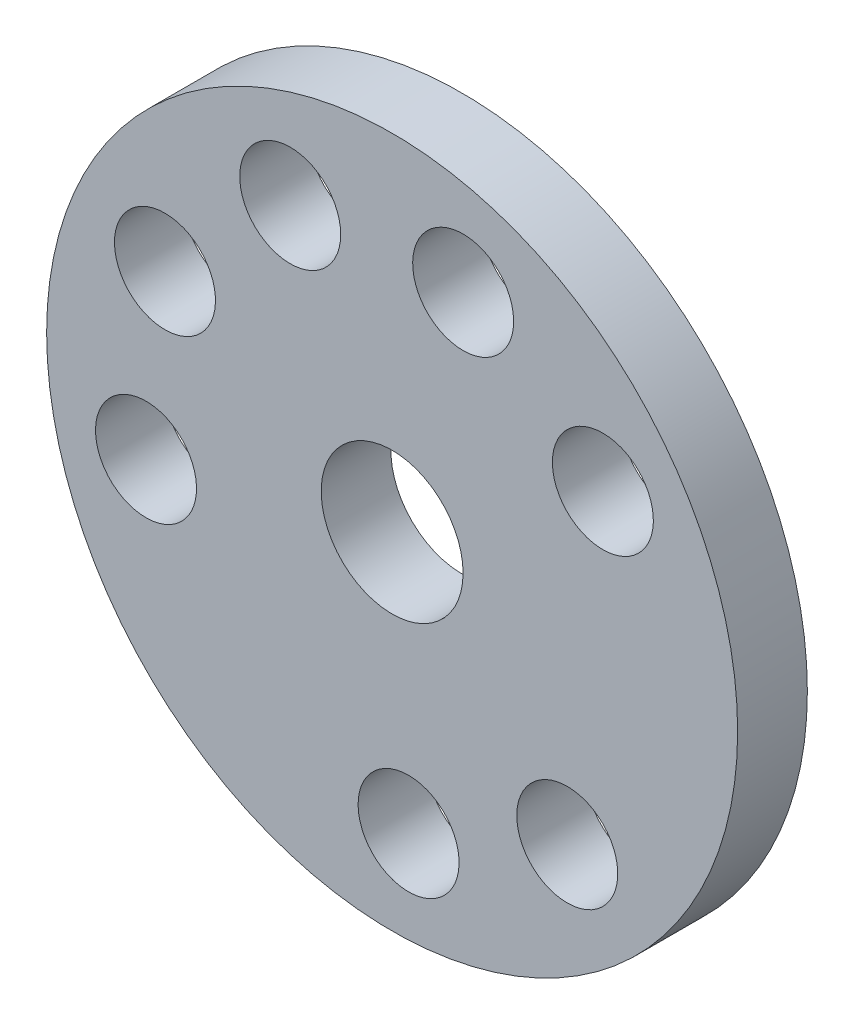
ISO-10303-21;
HEADER;
FILE_DESCRIPTION(('STEP AP214'),'2;1');
FILE_NAME('part.step','',(''),(''),'','','');
FILE_SCHEMA(('AUTOMOTIVE_DESIGN { 1 0 10303 214 1 1 1 1 }'));
ENDSEC;
DATA;
#1=APPLICATION_CONTEXT('core data for automotive mechanical design processes');
#2=APPLICATION_PROTOCOL_DEFINITION('international standard','automotive_design',2000,#1);
#3=PRODUCT_CONTEXT('',#1,'mechanical');
#4=PRODUCT('Part','Part','',(#3));
#5=PRODUCT_RELATED_PRODUCT_CATEGORY('part','',(#4));
#6=PRODUCT_DEFINITION_FORMATION('','',#4);
#7=PRODUCT_DEFINITION_CONTEXT('part definition',#1,'design');
#8=PRODUCT_DEFINITION('design','',#6,#7);
#9=PRODUCT_DEFINITION_SHAPE('','',#8);
#10=(LENGTH_UNIT() NAMED_UNIT(*) SI_UNIT(.MILLI.,.METRE.));
#11=(NAMED_UNIT(*) PLANE_ANGLE_UNIT() SI_UNIT($,.RADIAN.));
#12=(NAMED_UNIT(*) SI_UNIT($,.STERADIAN.) SOLID_ANGLE_UNIT());
#13=UNCERTAINTY_MEASURE_WITH_UNIT(LENGTH_MEASURE(1.E-05),#10,'distance_accuracy_value','');
#14=(GEOMETRIC_REPRESENTATION_CONTEXT(3) GLOBAL_UNCERTAINTY_ASSIGNED_CONTEXT((#13)) GLOBAL_UNIT_ASSIGNED_CONTEXT((#10,
#11,#12)) REPRESENTATION_CONTEXT('',''));
#15=CARTESIAN_POINT('',(0.,0.,0.));
#16=DIRECTION('',(0.,0.,1.));
#17=DIRECTION('',(1.,0.,0.));
#18=AXIS2_PLACEMENT_3D('',#15,#16,#17);
#19=CARTESIAN_POINT('',(0.,0.,10.));
#20=DIRECTION('',(0.,0.,-1.));
#21=DIRECTION('',(-1.,0.,0.));
#22=AXIS2_PLACEMENT_3D('',#19,#20,#21);
#23=CYLINDRICAL_SURFACE('',#22,49.5648300504576);
#24=CARTESIAN_POINT('',(0.,0.,10.));
#25=DIRECTION('',(0.,0.,1.));
#26=DIRECTION('',(1.,0.,0.));
#27=AXIS2_PLACEMENT_3D('',#24,#25,#26);
#28=CIRCLE('',#27,49.5648300504576);
#29=CARTESIAN_POINT('',(49.5648300504576,0.,10.));
#30=VERTEX_POINT('',#29);
#31=EDGE_CURVE('E10',#30,#30,#28,.T.);
#32=ORIENTED_EDGE('',*,*,#31,.F.);
#33=EDGE_LOOP('',(#32));
#34=FACE_BOUND('',#33,.T.);
#35=CARTESIAN_POINT('',(0.,0.,0.));
#36=DIRECTION('',(0.,0.,1.));
#37=DIRECTION('',(1.,0.,0.));
#38=AXIS2_PLACEMENT_3D('',#35,#36,#37);
#39=CIRCLE('',#38,49.5648300504576);
#40=CARTESIAN_POINT('',(49.5648300504576,0.,0.));
#41=VERTEX_POINT('',#40);
#42=EDGE_CURVE('E45',#41,#41,#39,.T.);
#43=ORIENTED_EDGE('',*,*,#42,.T.);
#44=EDGE_LOOP('',(#43));
#45=FACE_BOUND('',#44,.T.);
#46=ADVANCED_FACE('F42',(#34,#45),#23,.T.);
#47=CARTESIAN_POINT('',(0.,0.,10.));
#48=DIRECTION('',(0.,0.,1.));
#49=DIRECTION('',(1.,0.,0.));
#50=AXIS2_PLACEMENT_3D('',#47,#48,#49);
#51=PLANE('',#50);
#52=CARTESIAN_POINT('',(10.1874262457402,34.8877536913374,10.));
#53=DIRECTION('',(0.,0.,1.));
#54=DIRECTION('',(0.766044443118984,-0.642787609686532,0.));
#55=AXIS2_PLACEMENT_3D('',#52,#53,#54);
#56=CIRCLE('',#55,7.24237299513769);
#57=CARTESIAN_POINT('',(15.7354058336604,30.2324460653346,10.));
#58=VERTEX_POINT('',#57);
#59=EDGE_CURVE('E72',#58,#58,#56,.T.);
#60=ORIENTED_EDGE('',*,*,#59,.F.);
#61=EDGE_LOOP('',(#60));
#62=FACE_BOUND('',#61,.T.);
#63=CARTESIAN_POINT('',(30.2294370678213,20.1772184827953,10.));
#64=DIRECTION('',(0.,0.,1.));
#65=DIRECTION('',(0.173648177666939,-0.984807753012207,0.));
#66=AXIS2_PLACEMENT_3D('',#63,#64,#65);
#67=CIRCLE('',#66,7.24237299513769);
#68=CARTESIAN_POINT('',(31.4870619404112,13.0448734069775,10.));
#69=VERTEX_POINT('',#68);
#70=EDGE_CURVE('E78',#69,#69,#67,.T.);
#71=ORIENTED_EDGE('',*,*,#70,.F.);
#72=EDGE_LOOP('',(#71));
#73=FACE_BOUND('',#72,.T.);
#74=CARTESIAN_POINT('',(25.1199678548023,-26.2664467736602,10.));
#75=DIRECTION('',(0.,0.,1.));
#76=DIRECTION('',(-0.939692620785906,-0.342020143325674,0.));
#77=AXIS2_PLACEMENT_3D('',#74,#75,#76);
#78=CIRCLE('',#77,7.24237299513769);
#79=CARTESIAN_POINT('',(18.3143633942923,-28.7434842234752,10.));
#80=VERTEX_POINT('',#79);
#81=EDGE_CURVE('E84',#80,#80,#78,.T.);
#82=ORIENTED_EDGE('',*,*,#81,.F.);
#83=EDGE_LOOP('',(#82));
#84=FACE_BOUND('',#83,.T.);
#85=CARTESIAN_POINT('',(2.3592652498989,-36.2680696842339,10.));
#86=DIRECTION('',(0.,0.,1.));
#87=DIRECTION('',(-0.93969262078591,0.342020143325664,0.));
#88=AXIS2_PLACEMENT_3D('',#85,#86,#87);
#89=CIRCLE('',#88,7.24237299513769);
#90=CARTESIAN_POINT('',(-4.44633921061113,-33.791032234419,10.));
#91=VERTEX_POINT('',#90);
#92=EDGE_CURVE('E90',#91,#91,#89,.T.);
#93=ORIENTED_EDGE('',*,*,#92,.F.);
#94=EDGE_LOOP('',(#93));
#95=FACE_BOUND('',#94,.T.);
#96=CARTESIAN_POINT('',(-35.3073941005427,-8.6213069176771,10.));
#97=DIRECTION('',(0.,0.,1.));
#98=DIRECTION('',(0.173648177666928,0.984807753012208,0.));
#99=AXIS2_PLACEMENT_3D('',#96,#97,#98);
#100=CIRCLE('',#99,7.24237299513769);
#101=CARTESIAN_POINT('',(-34.0497692279529,-1.48896184185925,10.));
#102=VERTEX_POINT('',#101);
#103=EDGE_CURVE('E96',#102,#102,#100,.T.);
#104=ORIENTED_EDGE('',*,*,#103,.F.);
#105=EDGE_LOOP('',(#104));
#106=FACE_BOUND('',#105,.T.);
#107=CARTESIAN_POINT('',(-32.5887023177202,16.0908512014388,10.));
#108=DIRECTION('',(0.,0.,1.));
#109=DIRECTION('',(0.766044443118977,0.64278760968654,0.));
#110=AXIS2_PLACEMENT_3D('',#107,#108,#109);
#111=CIRCLE('',#110,7.24237299513769);
#112=CARTESIAN_POINT('',(-27.0407227298,20.7461588274417,10.));
#113=VERTEX_POINT('',#112);
#114=EDGE_CURVE('E66',#113,#113,#111,.T.);
#115=ORIENTED_EDGE('',*,*,#114,.F.);
#116=EDGE_LOOP('',(#115));
#117=FACE_BOUND('',#116,.T.);
#118=CARTESIAN_POINT('',(-14.6213945373535,33.2739212135101,10.));
#119=DIRECTION('',(0.,0.,1.));
#120=DIRECTION('',(1.,0.,0.));
#121=AXIS2_PLACEMENT_3D('',#118,#119,#120);
#122=CIRCLE('',#121,7.24237299513769);
#123=CARTESIAN_POINT('',(-7.37902154221579,33.2739212135101,10.));
#124=VERTEX_POINT('',#123);
#125=EDGE_CURVE('E60',#124,#124,#122,.T.);
#126=ORIENTED_EDGE('',*,*,#125,.F.);
#127=EDGE_LOOP('',(#126));
#128=FACE_BOUND('',#127,.T.);
#129=CARTESIAN_POINT('',(0.,0.,10.));
#130=DIRECTION('',(0.,0.,1.));
#131=DIRECTION('',(1.,0.,0.));
#132=AXIS2_PLACEMENT_3D('',#129,#130,#131);
#133=CIRCLE('',#132,10.1766476787604);
#134=CARTESIAN_POINT('',(10.1766476787604,0.,10.));
#135=VERTEX_POINT('',#134);
#136=EDGE_CURVE('E54',#135,#135,#133,.T.);
#137=ORIENTED_EDGE('',*,*,#136,.F.);
#138=EDGE_LOOP('',(#137));
#139=FACE_BOUND('',#138,.T.);
#140=ORIENTED_EDGE('',*,*,#31,.T.);
#141=EDGE_LOOP('',(#140));
#142=FACE_BOUND('',#141,.T.);
#143=ADVANCED_FACE('F113',(#62,#73,#84,#95,#106,#117,#128,#139,#142),#51,.T.);
#144=CARTESIAN_POINT('',(0.,0.,0.));
#145=DIRECTION('',(0.,0.,1.));
#146=DIRECTION('',(1.,0.,0.));
#147=AXIS2_PLACEMENT_3D('',#144,#145,#146);
#148=PLANE('',#147);
#149=CARTESIAN_POINT('',(10.1874262457402,34.8877536913374,0.));
#150=DIRECTION('',(0.,0.,1.));
#151=DIRECTION('',(0.766044443118984,-0.642787609686532,0.));
#152=AXIS2_PLACEMENT_3D('',#149,#150,#151);
#153=CIRCLE('',#152,7.24237299513769);
#154=CARTESIAN_POINT('',(15.7354058336604,30.2324460653346,0.));
#155=VERTEX_POINT('',#154);
#156=EDGE_CURVE('E75',#155,#155,#153,.T.);
#157=ORIENTED_EDGE('',*,*,#156,.T.);
#158=EDGE_LOOP('',(#157));
#159=FACE_BOUND('',#158,.T.);
#160=CARTESIAN_POINT('',(30.2294370678213,20.1772184827953,0.));
#161=DIRECTION('',(0.,0.,1.));
#162=DIRECTION('',(0.173648177666939,-0.984807753012207,0.));
#163=AXIS2_PLACEMENT_3D('',#160,#161,#162);
#164=CIRCLE('',#163,7.24237299513769);
#165=CARTESIAN_POINT('',(31.4870619404112,13.0448734069775,0.));
#166=VERTEX_POINT('',#165);
#167=EDGE_CURVE('E81',#166,#166,#164,.T.);
#168=ORIENTED_EDGE('',*,*,#167,.T.);
#169=EDGE_LOOP('',(#168));
#170=FACE_BOUND('',#169,.T.);
#171=CARTESIAN_POINT('',(25.1199678548023,-26.2664467736602,0.));
#172=DIRECTION('',(0.,0.,1.));
#173=DIRECTION('',(-0.939692620785906,-0.342020143325674,0.));
#174=AXIS2_PLACEMENT_3D('',#171,#172,#173);
#175=CIRCLE('',#174,7.24237299513769);
#176=CARTESIAN_POINT('',(18.3143633942923,-28.7434842234752,0.));
#177=VERTEX_POINT('',#176);
#178=EDGE_CURVE('E87',#177,#177,#175,.T.);
#179=ORIENTED_EDGE('',*,*,#178,.T.);
#180=EDGE_LOOP('',(#179));
#181=FACE_BOUND('',#180,.T.);
#182=CARTESIAN_POINT('',(2.3592652498989,-36.2680696842339,0.));
#183=DIRECTION('',(0.,0.,1.));
#184=DIRECTION('',(-0.93969262078591,0.342020143325664,0.));
#185=AXIS2_PLACEMENT_3D('',#182,#183,#184);
#186=CIRCLE('',#185,7.24237299513769);
#187=CARTESIAN_POINT('',(-4.44633921061113,-33.791032234419,0.));
#188=VERTEX_POINT('',#187);
#189=EDGE_CURVE('E93',#188,#188,#186,.T.);
#190=ORIENTED_EDGE('',*,*,#189,.T.);
#191=EDGE_LOOP('',(#190));
#192=FACE_BOUND('',#191,.T.);
#193=CARTESIAN_POINT('',(-35.3073941005427,-8.6213069176771,0.));
#194=DIRECTION('',(0.,0.,1.));
#195=DIRECTION('',(0.173648177666928,0.984807753012208,0.));
#196=AXIS2_PLACEMENT_3D('',#193,#194,#195);
#197=CIRCLE('',#196,7.24237299513769);
#198=CARTESIAN_POINT('',(-34.0497692279529,-1.48896184185925,0.));
#199=VERTEX_POINT('',#198);
#200=EDGE_CURVE('E69',#199,#199,#197,.T.);
#201=ORIENTED_EDGE('',*,*,#200,.T.);
#202=EDGE_LOOP('',(#201));
#203=FACE_BOUND('',#202,.T.);
#204=CARTESIAN_POINT('',(-32.5887023177202,16.0908512014388,0.));
#205=DIRECTION('',(0.,0.,1.));
#206=DIRECTION('',(0.766044443118977,0.64278760968654,0.));
#207=AXIS2_PLACEMENT_3D('',#204,#205,#206);
#208=CIRCLE('',#207,7.24237299513769);
#209=CARTESIAN_POINT('',(-27.0407227298,20.7461588274417,0.));
#210=VERTEX_POINT('',#209);
#211=EDGE_CURVE('E63',#210,#210,#208,.T.);
#212=ORIENTED_EDGE('',*,*,#211,.T.);
#213=EDGE_LOOP('',(#212));
#214=FACE_BOUND('',#213,.T.);
#215=CARTESIAN_POINT('',(-14.6213945373535,33.2739212135101,0.));
#216=DIRECTION('',(0.,0.,1.));
#217=DIRECTION('',(1.,0.,0.));
#218=AXIS2_PLACEMENT_3D('',#215,#216,#217);
#219=CIRCLE('',#218,7.24237299513769);
#220=CARTESIAN_POINT('',(-7.37902154221579,33.2739212135101,0.));
#221=VERTEX_POINT('',#220);
#222=EDGE_CURVE('E57',#221,#221,#219,.T.);
#223=ORIENTED_EDGE('',*,*,#222,.T.);
#224=EDGE_LOOP('',(#223));
#225=FACE_BOUND('',#224,.T.);
#226=CARTESIAN_POINT('',(0.,0.,0.));
#227=DIRECTION('',(0.,0.,1.));
#228=DIRECTION('',(1.,0.,0.));
#229=AXIS2_PLACEMENT_3D('',#226,#227,#228);
#230=CIRCLE('',#229,10.1766476787604);
#231=CARTESIAN_POINT('',(10.1766476787604,0.,0.));
#232=VERTEX_POINT('',#231);
#233=EDGE_CURVE('E52',#232,#232,#230,.T.);
#234=ORIENTED_EDGE('',*,*,#233,.T.);
#235=EDGE_LOOP('',(#234));
#236=FACE_BOUND('',#235,.T.);
#237=ORIENTED_EDGE('',*,*,#42,.F.);
#238=EDGE_LOOP('',(#237));
#239=FACE_BOUND('',#238,.T.);
#240=ADVANCED_FACE('F102',(#159,#170,#181,#192,#203,#214,#225,#236,#239),#148,.F.);
#241=CARTESIAN_POINT('',(0.,0.,0.));
#242=DIRECTION('',(0.,0.,1.));
#243=DIRECTION('',(1.,0.,0.));
#244=AXIS2_PLACEMENT_3D('',#241,#242,#243);
#245=CYLINDRICAL_SURFACE('',#244,10.1766476787604);
#246=ORIENTED_EDGE('',*,*,#233,.F.);
#247=EDGE_LOOP('',(#246));
#248=FACE_BOUND('',#247,.T.);
#249=ORIENTED_EDGE('',*,*,#136,.T.);
#250=EDGE_LOOP('',(#249));
#251=FACE_BOUND('',#250,.T.);
#252=ADVANCED_FACE('F124',(#248,#251),#245,.F.);
#253=CARTESIAN_POINT('',(-14.6213945373535,33.2739212135101,0.));
#254=DIRECTION('',(0.,0.,1.));
#255=DIRECTION('',(1.,0.,0.));
#256=AXIS2_PLACEMENT_3D('',#253,#254,#255);
#257=CYLINDRICAL_SURFACE('',#256,7.24237299513769);
#258=ORIENTED_EDGE('',*,*,#222,.F.);
#259=EDGE_LOOP('',(#258));
#260=FACE_BOUND('',#259,.T.);
#261=ORIENTED_EDGE('',*,*,#125,.T.);
#262=EDGE_LOOP('',(#261));
#263=FACE_BOUND('',#262,.T.);
#264=ADVANCED_FACE('F126',(#260,#263),#257,.F.);
#265=CARTESIAN_POINT('',(-32.5887023177202,16.0908512014388,0.));
#266=DIRECTION('',(0.,0.,1.));
#267=DIRECTION('',(1.,0.,0.));
#268=AXIS2_PLACEMENT_3D('',#265,#266,#267);
#269=CYLINDRICAL_SURFACE('',#268,7.24237299513769);
#270=ORIENTED_EDGE('',*,*,#211,.F.);
#271=EDGE_LOOP('',(#270));
#272=FACE_BOUND('',#271,.T.);
#273=ORIENTED_EDGE('',*,*,#114,.T.);
#274=EDGE_LOOP('',(#273));
#275=FACE_BOUND('',#274,.T.);
#276=ADVANCED_FACE('F109',(#272,#275),#269,.F.);
#277=CARTESIAN_POINT('',(-35.3073941005427,-8.6213069176771,0.));
#278=DIRECTION('',(0.,0.,1.));
#279=DIRECTION('',(1.,0.,0.));
#280=AXIS2_PLACEMENT_3D('',#277,#278,#279);
#281=CYLINDRICAL_SURFACE('',#280,7.24237299513769);
#282=ORIENTED_EDGE('',*,*,#200,.F.);
#283=EDGE_LOOP('',(#282));
#284=FACE_BOUND('',#283,.T.);
#285=ORIENTED_EDGE('',*,*,#103,.T.);
#286=EDGE_LOOP('',(#285));
#287=FACE_BOUND('',#286,.T.);
#288=ADVANCED_FACE('F105',(#284,#287),#281,.F.);
#289=CARTESIAN_POINT('',(2.3592652498989,-36.2680696842339,0.));
#290=DIRECTION('',(0.,0.,1.));
#291=DIRECTION('',(1.,0.,0.));
#292=AXIS2_PLACEMENT_3D('',#289,#290,#291);
#293=CYLINDRICAL_SURFACE('',#292,7.24237299513769);
#294=ORIENTED_EDGE('',*,*,#189,.F.);
#295=EDGE_LOOP('',(#294));
#296=FACE_BOUND('',#295,.T.);
#297=ORIENTED_EDGE('',*,*,#92,.T.);
#298=EDGE_LOOP('',(#297));
#299=FACE_BOUND('',#298,.T.);
#300=ADVANCED_FACE('F108',(#296,#299),#293,.F.);
#301=CARTESIAN_POINT('',(25.1199678548023,-26.2664467736602,0.));
#302=DIRECTION('',(0.,0.,1.));
#303=DIRECTION('',(1.,0.,0.));
#304=AXIS2_PLACEMENT_3D('',#301,#302,#303);
#305=CYLINDRICAL_SURFACE('',#304,7.24237299513769);
#306=ORIENTED_EDGE('',*,*,#178,.F.);
#307=EDGE_LOOP('',(#306));
#308=FACE_BOUND('',#307,.T.);
#309=ORIENTED_EDGE('',*,*,#81,.T.);
#310=EDGE_LOOP('',(#309));
#311=FACE_BOUND('',#310,.T.);
#312=ADVANCED_FACE('F183',(#308,#311),#305,.F.);
#313=CARTESIAN_POINT('',(30.2294370678213,20.1772184827953,0.));
#314=DIRECTION('',(0.,0.,1.));
#315=DIRECTION('',(1.,0.,0.));
#316=AXIS2_PLACEMENT_3D('',#313,#314,#315);
#317=CYLINDRICAL_SURFACE('',#316,7.24237299513769);
#318=ORIENTED_EDGE('',*,*,#167,.F.);
#319=EDGE_LOOP('',(#318));
#320=FACE_BOUND('',#319,.T.);
#321=ORIENTED_EDGE('',*,*,#70,.T.);
#322=EDGE_LOOP('',(#321));
#323=FACE_BOUND('',#322,.T.);
#324=ADVANCED_FACE('F194',(#320,#323),#317,.F.);
#325=CARTESIAN_POINT('',(10.1874262457402,34.8877536913374,0.));
#326=DIRECTION('',(0.,0.,1.));
#327=DIRECTION('',(1.,0.,0.));
#328=AXIS2_PLACEMENT_3D('',#325,#326,#327);
#329=CYLINDRICAL_SURFACE('',#328,7.24237299513769);
#330=ORIENTED_EDGE('',*,*,#156,.F.);
#331=EDGE_LOOP('',(#330));
#332=FACE_BOUND('',#331,.T.);
#333=ORIENTED_EDGE('',*,*,#59,.T.);
#334=EDGE_LOOP('',(#333));
#335=FACE_BOUND('',#334,.T.);
#336=ADVANCED_FACE('F205',(#332,#335),#329,.F.);
#337=CLOSED_SHELL('',(#46,#143,#240,#252,#264,#276,#288,#300,#312,#324,#336));
#338=MANIFOLD_SOLID_BREP('B2',#337);
#339=ADVANCED_BREP_SHAPE_REPRESENTATION('',(#18,#338),#14);
#340=SHAPE_DEFINITION_REPRESENTATION(#9,#339);
ENDSEC;
END-ISO-10303-21;
